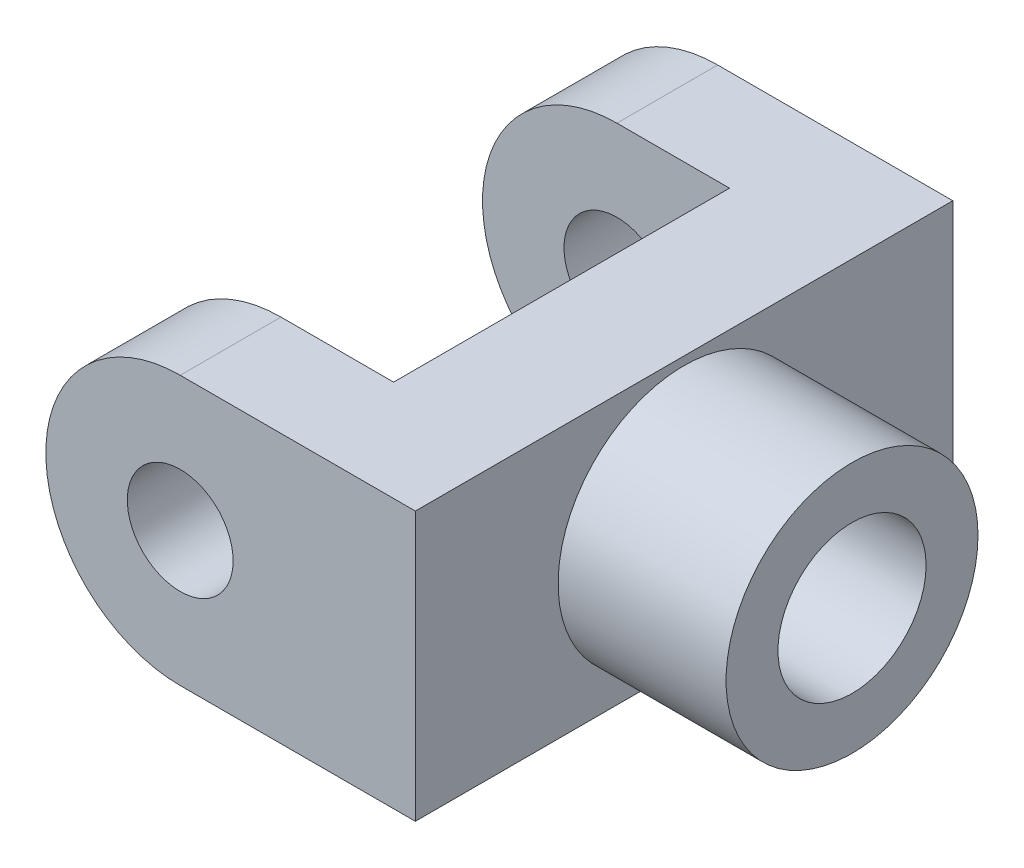
ISO-10303-21;
HEADER;
FILE_DESCRIPTION(('STEP AP214'),'2;1');
FILE_NAME('part.step','',(''),(''),'','','');
FILE_SCHEMA(('AUTOMOTIVE_DESIGN { 1 0 10303 214 1 1 1 1 }'));
ENDSEC;
DATA;
#1=APPLICATION_CONTEXT('core data for automotive mechanical design processes');
#2=APPLICATION_PROTOCOL_DEFINITION('international standard','automotive_design',2000,#1);
#3=PRODUCT_CONTEXT('',#1,'mechanical');
#4=PRODUCT('Part','Part','',(#3));
#5=PRODUCT_RELATED_PRODUCT_CATEGORY('part','',(#4));
#6=PRODUCT_DEFINITION_FORMATION('','',#4);
#7=PRODUCT_DEFINITION_CONTEXT('part definition',#1,'design');
#8=PRODUCT_DEFINITION('design','',#6,#7);
#9=PRODUCT_DEFINITION_SHAPE('','',#8);
#10=(LENGTH_UNIT() NAMED_UNIT(*) SI_UNIT(.MILLI.,.METRE.));
#11=(NAMED_UNIT(*) PLANE_ANGLE_UNIT() SI_UNIT($,.RADIAN.));
#12=(NAMED_UNIT(*) SI_UNIT($,.STERADIAN.) SOLID_ANGLE_UNIT());
#13=UNCERTAINTY_MEASURE_WITH_UNIT(LENGTH_MEASURE(1.E-05),#10,'distance_accuracy_value','');
#14=(GEOMETRIC_REPRESENTATION_CONTEXT(3) GLOBAL_UNCERTAINTY_ASSIGNED_CONTEXT((#13)) GLOBAL_UNIT_ASSIGNED_CONTEXT((#10,
#11,#12)) REPRESENTATION_CONTEXT('',''));
#15=CARTESIAN_POINT('',(0.,0.,0.));
#16=DIRECTION('',(0.,0.,1.));
#17=DIRECTION('',(1.,0.,0.));
#18=AXIS2_PLACEMENT_3D('',#15,#16,#17);
#19=CARTESIAN_POINT('',(0.,-5.08,20.32));
#20=DIRECTION('',(0.,-1.,0.));
#21=DIRECTION('',(0.,0.,-1.));
#22=AXIS2_PLACEMENT_3D('',#19,#20,#21);
#23=PLANE('',#22);
#24=DIRECTION('',(-1.,0.,0.));
#25=VECTOR('',#24,1.);
#26=CARTESIAN_POINT('',(0.,-5.08,16.51));
#27=LINE('',#26,#25);
#28=CARTESIAN_POINT('',(4.2578705309995,-5.08,16.51));
#29=VERTEX_POINT('',#28);
#30=CARTESIAN_POINT('',(0.,-5.08,16.51));
#31=VERTEX_POINT('',#30);
#32=EDGE_CURVE('E222',#29,#31,#27,.T.);
#33=ORIENTED_EDGE('',*,*,#32,.F.);
#34=DIRECTION('',(0.,0.,-1.));
#35=VECTOR('',#34,1.);
#36=CARTESIAN_POINT('',(4.2578705309995,-5.08,20.32));
#37=LINE('',#36,#35);
#38=CARTESIAN_POINT('',(4.2578705309995,-5.08,3.81));
#39=VERTEX_POINT('',#38);
#40=EDGE_CURVE('E159',#29,#39,#37,.T.);
#41=ORIENTED_EDGE('',*,*,#40,.T.);
#42=DIRECTION('',(-1.,0.,0.));
#43=VECTOR('',#42,1.);
#44=CARTESIAN_POINT('',(0.,-5.08,3.81));
#45=LINE('',#44,#43);
#46=CARTESIAN_POINT('',(0.,-5.08,3.81));
#47=VERTEX_POINT('',#46);
#48=EDGE_CURVE('E135',#39,#47,#45,.T.);
#49=ORIENTED_EDGE('',*,*,#48,.T.);
#50=DIRECTION('',(0.,0.,-1.));
#51=VECTOR('',#50,1.);
#52=CARTESIAN_POINT('',(0.,-5.08,20.32));
#53=LINE('',#52,#51);
#54=CARTESIAN_POINT('',(0.,-5.08,0.));
#55=VERTEX_POINT('',#54);
#56=EDGE_CURVE('E134',#47,#55,#53,.T.);
#57=ORIENTED_EDGE('',*,*,#56,.T.);
#58=DIRECTION('',(-1.,0.,0.));
#59=VECTOR('',#58,1.);
#60=CARTESIAN_POINT('',(0.,-5.08,0.));
#61=LINE('',#60,#59);
#62=CARTESIAN_POINT('',(8.89,-5.08,0.));
#63=VERTEX_POINT('',#62);
#64=EDGE_CURVE('E208',#63,#55,#61,.T.);
#65=ORIENTED_EDGE('',*,*,#64,.F.);
#66=DIRECTION('',(0.,0.,-1.));
#67=VECTOR('',#66,1.);
#68=CARTESIAN_POINT('',(8.89,-5.08,20.32));
#69=LINE('',#68,#67);
#70=CARTESIAN_POINT('',(8.89,-5.08,20.32));
#71=VERTEX_POINT('',#70);
#72=EDGE_CURVE('E151',#71,#63,#69,.T.);
#73=ORIENTED_EDGE('',*,*,#72,.F.);
#74=DIRECTION('',(-1.,0.,0.));
#75=VECTOR('',#74,1.);
#76=CARTESIAN_POINT('',(0.,-5.08,20.32));
#77=LINE('',#76,#75);
#78=CARTESIAN_POINT('',(0.,-5.08,20.32));
#79=VERTEX_POINT('',#78);
#80=EDGE_CURVE('E202',#71,#79,#77,.T.);
#81=ORIENTED_EDGE('',*,*,#80,.T.);
#82=EDGE_CURVE('E142',#79,#31,#53,.T.);
#83=ORIENTED_EDGE('',*,*,#82,.T.);
#84=EDGE_LOOP('',(#33,#41,#49,#57,#65,#73,#81,#83));
#85=FACE_BOUND('',#84,.T.);
#86=ADVANCED_FACE('F43',(#85),#23,.T.);
#87=CARTESIAN_POINT('',(0.,5.08,20.32));
#88=DIRECTION('',(0.,1.,0.));
#89=DIRECTION('',(0.,0.,1.));
#90=AXIS2_PLACEMENT_3D('',#87,#88,#89);
#91=PLANE('',#90);
#92=DIRECTION('',(0.,0.,1.));
#93=VECTOR('',#92,1.);
#94=CARTESIAN_POINT('',(4.2578705309995,5.08,20.32));
#95=LINE('',#94,#93);
#96=CARTESIAN_POINT('',(4.2578705309995,5.08,3.81));
#97=VERTEX_POINT('',#96);
#98=CARTESIAN_POINT('',(4.2578705309995,5.08,16.51));
#99=VERTEX_POINT('',#98);
#100=EDGE_CURVE('E162',#97,#99,#95,.T.);
#101=ORIENTED_EDGE('',*,*,#100,.T.);
#102=DIRECTION('',(1.,0.,0.));
#103=VECTOR('',#102,1.);
#104=CARTESIAN_POINT('',(0.,5.08,16.51));
#105=LINE('',#104,#103);
#106=CARTESIAN_POINT('',(0.,5.08,16.51));
#107=VERTEX_POINT('',#106);
#108=EDGE_CURVE('E59',#107,#99,#105,.T.);
#109=ORIENTED_EDGE('',*,*,#108,.F.);
#110=DIRECTION('',(0.,0.,-1.));
#111=VECTOR('',#110,1.);
#112=CARTESIAN_POINT('',(0.,5.08,20.32));
#113=LINE('',#112,#111);
#114=CARTESIAN_POINT('',(0.,5.08,20.32));
#115=VERTEX_POINT('',#114);
#116=EDGE_CURVE('E141',#115,#107,#113,.T.);
#117=ORIENTED_EDGE('',*,*,#116,.F.);
#118=DIRECTION('',(1.,0.,0.));
#119=VECTOR('',#118,1.);
#120=CARTESIAN_POINT('',(0.,5.08,20.32));
#121=LINE('',#120,#119);
#122=CARTESIAN_POINT('',(8.89,5.08,20.32));
#123=VERTEX_POINT('',#122);
#124=EDGE_CURVE('E194',#115,#123,#121,.T.);
#125=ORIENTED_EDGE('',*,*,#124,.T.);
#126=DIRECTION('',(0.,0.,-1.));
#127=VECTOR('',#126,1.);
#128=CARTESIAN_POINT('',(8.89,5.08,20.32));
#129=LINE('',#128,#127);
#130=CARTESIAN_POINT('',(8.89,5.08,0.));
#131=VERTEX_POINT('',#130);
#132=EDGE_CURVE('E145',#123,#131,#129,.T.);
#133=ORIENTED_EDGE('',*,*,#132,.T.);
#134=DIRECTION('',(1.,0.,0.));
#135=VECTOR('',#134,1.);
#136=CARTESIAN_POINT('',(0.,5.08,0.));
#137=LINE('',#136,#135);
#138=CARTESIAN_POINT('',(0.,5.08,0.));
#139=VERTEX_POINT('',#138);
#140=EDGE_CURVE('E140',#139,#131,#137,.T.);
#141=ORIENTED_EDGE('',*,*,#140,.F.);
#142=CARTESIAN_POINT('',(0.,5.08,3.81));
#143=VERTEX_POINT('',#142);
#144=EDGE_CURVE('E132',#143,#139,#113,.T.);
#145=ORIENTED_EDGE('',*,*,#144,.F.);
#146=DIRECTION('',(1.,0.,0.));
#147=VECTOR('',#146,1.);
#148=CARTESIAN_POINT('',(0.,5.08,3.81));
#149=LINE('',#148,#147);
#150=EDGE_CURVE('E67',#143,#97,#149,.T.);
#151=ORIENTED_EDGE('',*,*,#150,.T.);
#152=EDGE_LOOP('',(#101,#109,#117,#125,#133,#141,#145,#151));
#153=FACE_BOUND('',#152,.T.);
#154=ADVANCED_FACE('F138',(#153),#91,.T.);
#155=CARTESIAN_POINT('',(0.,0.,20.32));
#156=DIRECTION('',(0.,0.,-1.));
#157=DIRECTION('',(-1.,0.,0.));
#158=AXIS2_PLACEMENT_3D('',#155,#156,#157);
#159=CYLINDRICAL_SURFACE('',#158,5.08);
#160=CARTESIAN_POINT('',(0.,0.,3.81));
#161=DIRECTION('',(0.,0.,1.));
#162=DIRECTION('',(1.,0.,0.));
#163=AXIS2_PLACEMENT_3D('',#160,#161,#162);
#164=CIRCLE('',#163,5.08);
#165=EDGE_CURVE('E122',#143,#47,#164,.T.);
#166=ORIENTED_EDGE('',*,*,#165,.F.);
#167=ORIENTED_EDGE('',*,*,#144,.T.);
#168=CARTESIAN_POINT('',(0.,0.,0.));
#169=DIRECTION('',(0.,0.,1.));
#170=DIRECTION('',(1.,0.,0.));
#171=AXIS2_PLACEMENT_3D('',#168,#169,#170);
#172=CIRCLE('',#171,5.08);
#173=EDGE_CURVE('E215',#139,#55,#172,.T.);
#174=ORIENTED_EDGE('',*,*,#173,.T.);
#175=ORIENTED_EDGE('',*,*,#56,.F.);
#176=EDGE_LOOP('',(#166,#167,#174,#175));
#177=FACE_BOUND('',#176,.T.);
#178=ADVANCED_FACE('F130',(#177),#159,.T.);
#179=CARTESIAN_POINT('',(0.,0.,20.32));
#180=DIRECTION('',(0.,0.,-1.));
#181=DIRECTION('',(-1.,0.,0.));
#182=AXIS2_PLACEMENT_3D('',#179,#180,#181);
#183=CYLINDRICAL_SURFACE('',#182,2.);
#184=CARTESIAN_POINT('',(0.,0.,0.));
#185=DIRECTION('',(0.,0.,1.));
#186=DIRECTION('',(1.,0.,0.));
#187=AXIS2_PLACEMENT_3D('',#184,#185,#186);
#188=CIRCLE('',#187,2.);
#189=CARTESIAN_POINT('',(2.,0.,0.));
#190=VERTEX_POINT('',#189);
#191=EDGE_CURVE('E216',#190,#190,#188,.T.);
#192=ORIENTED_EDGE('',*,*,#191,.F.);
#193=EDGE_LOOP('',(#192));
#194=FACE_BOUND('',#193,.T.);
#195=CARTESIAN_POINT('',(0.,0.,3.81));
#196=DIRECTION('',(0.,0.,1.));
#197=DIRECTION('',(1.,0.,0.));
#198=AXIS2_PLACEMENT_3D('',#195,#196,#197);
#199=CIRCLE('',#198,2.);
#200=CARTESIAN_POINT('',(2.,0.,3.81));
#201=VERTEX_POINT('',#200);
#202=EDGE_CURVE('E224',#201,#201,#199,.T.);
#203=ORIENTED_EDGE('',*,*,#202,.T.);
#204=EDGE_LOOP('',(#203));
#205=FACE_BOUND('',#204,.T.);
#206=ADVANCED_FACE('F267',(#194,#205),#183,.F.);
#207=CARTESIAN_POINT('',(8.89,0.,20.32));
#208=DIRECTION('',(1.,0.,0.));
#209=DIRECTION('',(0.,0.,-1.));
#210=AXIS2_PLACEMENT_3D('',#207,#208,#209);
#211=PLANE('',#210);
#212=CARTESIAN_POINT('',(8.89,0.,10.16));
#213=DIRECTION('',(1.,0.,0.));
#214=DIRECTION('',(0.,0.,-1.));
#215=AXIS2_PLACEMENT_3D('',#212,#213,#214);
#216=CIRCLE('',#215,4.7625);
#217=CARTESIAN_POINT('',(8.89,0.,5.3975));
#218=VERTEX_POINT('',#217);
#219=EDGE_CURVE('E153',#218,#218,#216,.T.);
#220=ORIENTED_EDGE('',*,*,#219,.F.);
#221=EDGE_LOOP('',(#220));
#222=FACE_BOUND('',#221,.T.);
#223=DIRECTION('',(0.,-1.,0.));
#224=VECTOR('',#223,1.);
#225=CARTESIAN_POINT('',(8.89,0.,0.));
#226=LINE('',#225,#224);
#227=EDGE_CURVE('E211',#131,#63,#226,.T.);
#228=ORIENTED_EDGE('',*,*,#227,.F.);
#229=ORIENTED_EDGE('',*,*,#132,.F.);
#230=DIRECTION('',(0.,-1.,0.));
#231=VECTOR('',#230,1.);
#232=CARTESIAN_POINT('',(8.89,0.,20.32));
#233=LINE('',#232,#231);
#234=EDGE_CURVE('E200',#123,#71,#233,.T.);
#235=ORIENTED_EDGE('',*,*,#234,.T.);
#236=ORIENTED_EDGE('',*,*,#72,.T.);
#237=EDGE_LOOP('',(#228,#229,#235,#236));
#238=FACE_BOUND('',#237,.T.);
#239=ADVANCED_FACE('F264',(#222,#238),#211,.T.);
#240=ORIENTED_EDGE('',*,*,#116,.T.);
#241=CARTESIAN_POINT('',(0.,0.,16.51));
#242=DIRECTION('',(0.,0.,1.));
#243=DIRECTION('',(1.,0.,0.));
#244=AXIS2_PLACEMENT_3D('',#241,#242,#243);
#245=CIRCLE('',#244,5.08);
#246=EDGE_CURVE('E182',#107,#31,#245,.T.);
#247=ORIENTED_EDGE('',*,*,#246,.T.);
#248=ORIENTED_EDGE('',*,*,#82,.F.);
#249=CARTESIAN_POINT('',(0.,0.,20.32));
#250=DIRECTION('',(0.,0.,1.));
#251=DIRECTION('',(1.,0.,0.));
#252=AXIS2_PLACEMENT_3D('',#249,#250,#251);
#253=CIRCLE('',#252,5.08);
#254=EDGE_CURVE('E188',#115,#79,#253,.T.);
#255=ORIENTED_EDGE('',*,*,#254,.F.);
#256=EDGE_LOOP('',(#240,#247,#248,#255));
#257=FACE_BOUND('',#256,.T.);
#258=ADVANCED_FACE('F186',(#257),#159,.T.);
#259=CARTESIAN_POINT('',(0.,0.,16.51));
#260=DIRECTION('',(0.,0.,1.));
#261=DIRECTION('',(1.,0.,0.));
#262=AXIS2_PLACEMENT_3D('',#259,#260,#261);
#263=CIRCLE('',#262,2.);
#264=CARTESIAN_POINT('',(2.,0.,16.51));
#265=VERTEX_POINT('',#264);
#266=EDGE_CURVE('E178',#265,#265,#263,.T.);
#267=ORIENTED_EDGE('',*,*,#266,.F.);
#268=EDGE_LOOP('',(#267));
#269=FACE_BOUND('',#268,.T.);
#270=CARTESIAN_POINT('',(0.,0.,20.32));
#271=DIRECTION('',(0.,0.,1.));
#272=DIRECTION('',(1.,0.,0.));
#273=AXIS2_PLACEMENT_3D('',#270,#271,#272);
#274=CIRCLE('',#273,2.);
#275=CARTESIAN_POINT('',(2.,0.,20.32));
#276=VERTEX_POINT('',#275);
#277=EDGE_CURVE('E193',#276,#276,#274,.T.);
#278=ORIENTED_EDGE('',*,*,#277,.T.);
#279=EDGE_LOOP('',(#278));
#280=FACE_BOUND('',#279,.T.);
#281=ADVANCED_FACE('F294',(#269,#280),#183,.F.);
#282=CARTESIAN_POINT('',(0.,0.,20.32));
#283=DIRECTION('',(0.,0.,1.));
#284=DIRECTION('',(1.,0.,0.));
#285=AXIS2_PLACEMENT_3D('',#282,#283,#284);
#286=PLANE('',#285);
#287=ORIENTED_EDGE('',*,*,#80,.F.);
#288=ORIENTED_EDGE('',*,*,#234,.F.);
#289=ORIENTED_EDGE('',*,*,#124,.F.);
#290=ORIENTED_EDGE('',*,*,#254,.T.);
#291=EDGE_LOOP('',(#287,#288,#289,#290));
#292=FACE_BOUND('',#291,.T.);
#293=ORIENTED_EDGE('',*,*,#277,.F.);
#294=EDGE_LOOP('',(#293));
#295=FACE_BOUND('',#294,.T.);
#296=ADVANCED_FACE('F197',(#292,#295),#286,.T.);
#297=CARTESIAN_POINT('',(0.,0.,0.));
#298=DIRECTION('',(0.,0.,1.));
#299=DIRECTION('',(1.,0.,0.));
#300=AXIS2_PLACEMENT_3D('',#297,#298,#299);
#301=PLANE('',#300);
#302=ORIENTED_EDGE('',*,*,#64,.T.);
#303=ORIENTED_EDGE('',*,*,#173,.F.);
#304=ORIENTED_EDGE('',*,*,#140,.T.);
#305=ORIENTED_EDGE('',*,*,#227,.T.);
#306=EDGE_LOOP('',(#302,#303,#304,#305));
#307=FACE_BOUND('',#306,.T.);
#308=ORIENTED_EDGE('',*,*,#191,.T.);
#309=EDGE_LOOP('',(#308));
#310=FACE_BOUND('',#309,.T.);
#311=ADVANCED_FACE('F272',(#307,#310),#301,.F.);
#312=CARTESIAN_POINT('',(3.81,0.,3.81));
#313=DIRECTION('',(-1.,0.,0.));
#314=DIRECTION('',(0.,0.,1.));
#315=AXIS2_PLACEMENT_3D('',#312,#313,#314);
#316=PLANE('',#315);
#317=DIRECTION('',(0.,-1.,0.));
#318=VECTOR('',#317,1.);
#319=CARTESIAN_POINT('',(3.81,0.,3.81));
#320=LINE('',#319,#318);
#321=CARTESIAN_POINT('',(3.81,2.53999999999995,3.81));
#322=VERTEX_POINT('',#321);
#323=CARTESIAN_POINT('',(3.81,-2.53999999999995,3.81));
#324=VERTEX_POINT('',#323);
#325=EDGE_CURVE('E126',#322,#324,#320,.T.);
#326=ORIENTED_EDGE('',*,*,#325,.T.);
#327=DIRECTION('',(0.,0.,1.));
#328=VECTOR('',#327,1.);
#329=CARTESIAN_POINT('',(3.81,-2.53999999999995,3.81));
#330=LINE('',#329,#328);
#331=CARTESIAN_POINT('',(3.81,-2.53999999999995,16.51));
#332=VERTEX_POINT('',#331);
#333=EDGE_CURVE('E156',#324,#332,#330,.T.);
#334=ORIENTED_EDGE('',*,*,#333,.T.);
#335=DIRECTION('',(0.,-1.,0.));
#336=VECTOR('',#335,1.);
#337=CARTESIAN_POINT('',(3.81,0.,16.51));
#338=LINE('',#337,#336);
#339=CARTESIAN_POINT('',(3.81,2.53999999999995,16.51));
#340=VERTEX_POINT('',#339);
#341=EDGE_CURVE('E171',#340,#332,#338,.T.);
#342=ORIENTED_EDGE('',*,*,#341,.F.);
#343=DIRECTION('',(0.,0.,-1.));
#344=VECTOR('',#343,1.);
#345=CARTESIAN_POINT('',(3.81,2.53999999999995,3.81));
#346=LINE('',#345,#344);
#347=EDGE_CURVE('E154',#340,#322,#346,.T.);
#348=ORIENTED_EDGE('',*,*,#347,.T.);
#349=EDGE_LOOP('',(#326,#334,#342,#348));
#350=FACE_BOUND('',#349,.T.);
#351=ADVANCED_FACE('F176',(#350),#316,.T.);
#352=CARTESIAN_POINT('',(0.,0.,3.81));
#353=DIRECTION('',(0.,0.,1.));
#354=DIRECTION('',(1.,0.,0.));
#355=AXIS2_PLACEMENT_3D('',#352,#353,#354);
#356=PLANE('',#355);
#357=ORIENTED_EDGE('',*,*,#202,.F.);
#358=EDGE_LOOP('',(#357));
#359=FACE_BOUND('',#358,.T.);
#360=ORIENTED_EDGE('',*,*,#325,.F.);
#361=DIRECTION('',(-0.173648177666928,-0.984807753012209,0.));
#362=VECTOR('',#361,1.);
#363=CARTESIAN_POINT('',(4.2578705309995,5.08,3.81));
#364=LINE('',#363,#362);
#365=EDGE_CURVE('E11',#322,#97,#364,.F.);
#366=ORIENTED_EDGE('',*,*,#365,.T.);
#367=ORIENTED_EDGE('',*,*,#150,.F.);
#368=ORIENTED_EDGE('',*,*,#165,.T.);
#369=ORIENTED_EDGE('',*,*,#48,.F.);
#370=DIRECTION('',(0.173648177666928,-0.984807753012209,0.));
#371=VECTOR('',#370,1.);
#372=CARTESIAN_POINT('',(3.81,-2.53999999999995,3.81));
#373=LINE('',#372,#371);
#374=EDGE_CURVE('E167',#39,#324,#373,.F.);
#375=ORIENTED_EDGE('',*,*,#374,.T.);
#376=EDGE_LOOP('',(#360,#366,#367,#368,#369,#375));
#377=FACE_BOUND('',#376,.T.);
#378=ADVANCED_FACE('F121',(#359,#377),#356,.T.);
#379=CARTESIAN_POINT('',(0.,0.,16.51));
#380=DIRECTION('',(0.,0.,1.));
#381=DIRECTION('',(1.,0.,0.));
#382=AXIS2_PLACEMENT_3D('',#379,#380,#381);
#383=PLANE('',#382);
#384=ORIENTED_EDGE('',*,*,#266,.T.);
#385=EDGE_LOOP('',(#384));
#386=FACE_BOUND('',#385,.T.);
#387=ORIENTED_EDGE('',*,*,#108,.T.);
#388=DIRECTION('',(0.173648177666928,0.984807753012209,0.));
#389=VECTOR('',#388,1.);
#390=CARTESIAN_POINT('',(3.26074886057357,-0.574958001433497,16.51));
#391=LINE('',#390,#389);
#392=EDGE_CURVE('E52',#99,#340,#391,.F.);
#393=ORIENTED_EDGE('',*,*,#392,.T.);
#394=ORIENTED_EDGE('',*,*,#341,.T.);
#395=DIRECTION('',(-0.173648177666928,0.984807753012209,0.));
#396=VECTOR('',#395,1.);
#397=CARTESIAN_POINT('',(3.26074886057358,0.574958001433497,16.51));
#398=LINE('',#397,#396);
#399=EDGE_CURVE('E164',#332,#29,#398,.F.);
#400=ORIENTED_EDGE('',*,*,#399,.T.);
#401=ORIENTED_EDGE('',*,*,#32,.T.);
#402=ORIENTED_EDGE('',*,*,#246,.F.);
#403=EDGE_LOOP('',(#387,#393,#394,#400,#401,#402));
#404=FACE_BOUND('',#403,.T.);
#405=ADVANCED_FACE('F170',(#386,#404),#383,.F.);
#406=CARTESIAN_POINT('',(15.24,0.,10.16));
#407=DIRECTION('',(-1.,0.,0.));
#408=DIRECTION('',(0.,0.,1.));
#409=AXIS2_PLACEMENT_3D('',#406,#407,#408);
#410=CYLINDRICAL_SURFACE('',#409,4.7625);
#411=CARTESIAN_POINT('',(15.24,0.,10.16));
#412=DIRECTION('',(1.,0.,0.));
#413=DIRECTION('',(0.,0.,-1.));
#414=AXIS2_PLACEMENT_3D('',#411,#412,#413);
#415=CIRCLE('',#414,4.7625);
#416=CARTESIAN_POINT('',(15.24,0.,5.3975));
#417=VERTEX_POINT('',#416);
#418=EDGE_CURVE('E228',#417,#417,#415,.T.);
#419=ORIENTED_EDGE('',*,*,#418,.F.);
#420=EDGE_LOOP('',(#419));
#421=FACE_BOUND('',#420,.T.);
#422=ORIENTED_EDGE('',*,*,#219,.T.);
#423=EDGE_LOOP('',(#422));
#424=FACE_BOUND('',#423,.T.);
#425=ADVANCED_FACE('F255',(#421,#424),#410,.T.);
#426=CARTESIAN_POINT('',(15.24,0.,10.16));
#427=DIRECTION('',(1.,0.,0.));
#428=DIRECTION('',(0.,0.,-1.));
#429=AXIS2_PLACEMENT_3D('',#426,#427,#428);
#430=PLANE('',#429);
#431=CARTESIAN_POINT('',(15.24,0.,10.16));
#432=DIRECTION('',(1.,0.,0.));
#433=DIRECTION('',(0.,0.,-1.));
#434=AXIS2_PLACEMENT_3D('',#431,#432,#433);
#435=CIRCLE('',#434,2.8);
#436=CARTESIAN_POINT('',(15.24,0.,7.36));
#437=VERTEX_POINT('',#436);
#438=EDGE_CURVE('E238',#437,#437,#435,.T.);
#439=ORIENTED_EDGE('',*,*,#438,.F.);
#440=EDGE_LOOP('',(#439));
#441=FACE_BOUND('',#440,.T.);
#442=ORIENTED_EDGE('',*,*,#418,.T.);
#443=EDGE_LOOP('',(#442));
#444=FACE_BOUND('',#443,.T.);
#445=ADVANCED_FACE('F249',(#441,#444),#430,.T.);
#446=CARTESIAN_POINT('',(10.54,0.,10.16));
#447=DIRECTION('',(1.,0.,0.));
#448=DIRECTION('',(0.,0.,-1.));
#449=AXIS2_PLACEMENT_3D('',#446,#447,#448);
#450=CYLINDRICAL_SURFACE('',#449,2.8);
#451=CARTESIAN_POINT('',(10.54,0.,10.16));
#452=DIRECTION('',(1.,0.,0.));
#453=DIRECTION('',(0.,0.,-1.));
#454=AXIS2_PLACEMENT_3D('',#451,#452,#453);
#455=CIRCLE('',#454,2.8);
#456=CARTESIAN_POINT('',(10.54,0.,7.36));
#457=VERTEX_POINT('',#456);
#458=EDGE_CURVE('E237',#457,#457,#455,.T.);
#459=ORIENTED_EDGE('',*,*,#458,.F.);
#460=EDGE_LOOP('',(#459));
#461=FACE_BOUND('',#460,.T.);
#462=ORIENTED_EDGE('',*,*,#438,.T.);
#463=EDGE_LOOP('',(#462));
#464=FACE_BOUND('',#463,.T.);
#465=ADVANCED_FACE('F246',(#461,#464),#450,.F.);
#466=CARTESIAN_POINT('',(10.54,0.,10.16));
#467=DIRECTION('',(1.,0.,0.));
#468=DIRECTION('',(0.,0.,-1.));
#469=AXIS2_PLACEMENT_3D('',#466,#467,#468);
#470=PLANE('',#469);
#471=ORIENTED_EDGE('',*,*,#458,.T.);
#472=EDGE_LOOP('',(#471));
#473=FACE_BOUND('',#472,.T.);
#474=ADVANCED_FACE('F244',(#473),#470,.T.);
#475=CARTESIAN_POINT('',(3.81,-2.53999999999995,3.81));
#476=DIRECTION('',(0.984807753012208,0.173648177666928,0.));
#477=DIRECTION('',(0.,0.,1.));
#478=AXIS2_PLACEMENT_3D('',#475,#476,#477);
#479=PLANE('',#478);
#480=ORIENTED_EDGE('',*,*,#374,.F.);
#481=ORIENTED_EDGE('',*,*,#40,.F.);
#482=ORIENTED_EDGE('',*,*,#399,.F.);
#483=ORIENTED_EDGE('',*,*,#333,.F.);
#484=EDGE_LOOP('',(#480,#481,#482,#483));
#485=FACE_BOUND('',#484,.T.);
#486=ADVANCED_FACE('F276',(#485),#479,.F.);
#487=CARTESIAN_POINT('',(4.2578705309995,5.08,20.32));
#488=DIRECTION('',(0.984807753012208,-0.173648177666928,0.));
#489=DIRECTION('',(0.,0.,1.));
#490=AXIS2_PLACEMENT_3D('',#487,#488,#489);
#491=PLANE('',#490);
#492=ORIENTED_EDGE('',*,*,#365,.F.);
#493=ORIENTED_EDGE('',*,*,#347,.F.);
#494=ORIENTED_EDGE('',*,*,#392,.F.);
#495=ORIENTED_EDGE('',*,*,#100,.F.);
#496=EDGE_LOOP('',(#492,#493,#494,#495));
#497=FACE_BOUND('',#496,.T.);
#498=ADVANCED_FACE('F46',(#497),#491,.F.);
#499=CLOSED_SHELL('',(#86,#154,#178,#206,#239,#258,#281,#296,#311,#351,#378,#405,#425,#445,#465,
#474,#486,#498));
#500=MANIFOLD_SOLID_BREP('B2',#499);
#501=ADVANCED_BREP_SHAPE_REPRESENTATION('',(#18,#500),#14);
#502=SHAPE_DEFINITION_REPRESENTATION(#9,#501);
ENDSEC;
END-ISO-10303-21;
